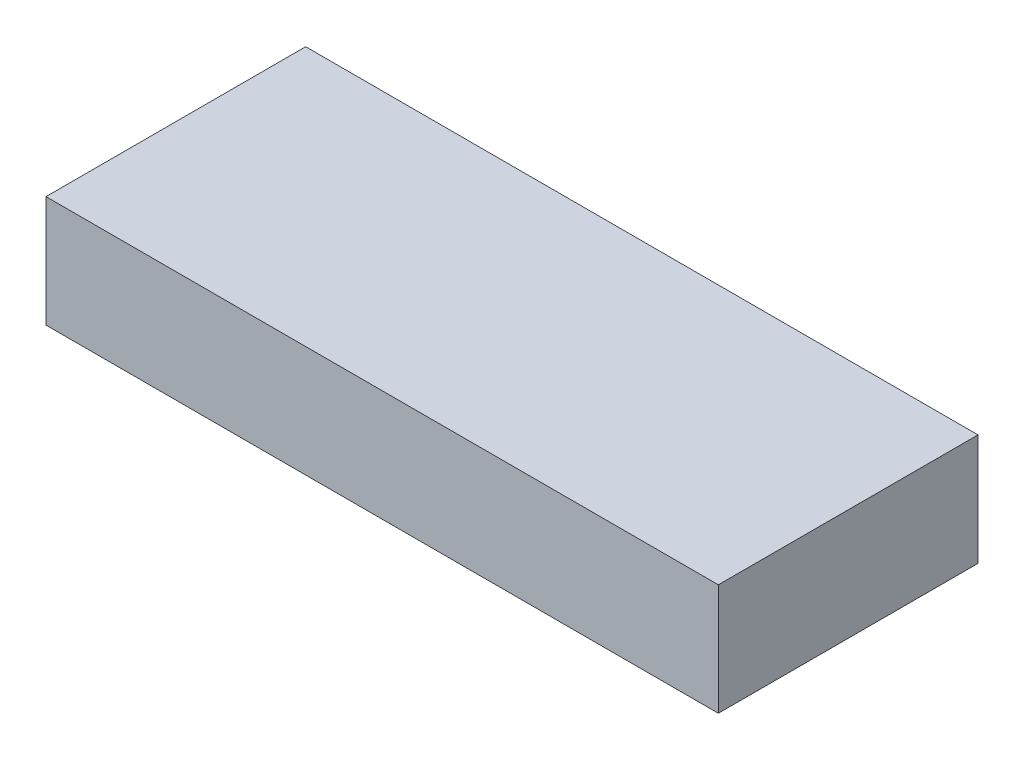
ISO-10303-21;
HEADER;
FILE_DESCRIPTION(('STEP AP214'),'2;1');
FILE_NAME('part.step','',(''),(''),'','','');
FILE_SCHEMA(('AUTOMOTIVE_DESIGN { 1 0 10303 214 1 1 1 1 }'));
ENDSEC;
DATA;
#1=APPLICATION_CONTEXT('core data for automotive mechanical design processes');
#2=APPLICATION_PROTOCOL_DEFINITION('international standard','automotive_design',2000,#1);
#3=PRODUCT_CONTEXT('',#1,'mechanical');
#4=PRODUCT('Part','Part','',(#3));
#5=PRODUCT_RELATED_PRODUCT_CATEGORY('part','',(#4));
#6=PRODUCT_DEFINITION_FORMATION('','',#4);
#7=PRODUCT_DEFINITION_CONTEXT('part definition',#1,'design');
#8=PRODUCT_DEFINITION('design','',#6,#7);
#9=PRODUCT_DEFINITION_SHAPE('','',#8);
#10=(LENGTH_UNIT() NAMED_UNIT(*) SI_UNIT(.MILLI.,.METRE.));
#11=(NAMED_UNIT(*) PLANE_ANGLE_UNIT() SI_UNIT($,.RADIAN.));
#12=(NAMED_UNIT(*) SI_UNIT($,.STERADIAN.) SOLID_ANGLE_UNIT());
#13=UNCERTAINTY_MEASURE_WITH_UNIT(LENGTH_MEASURE(1.E-05),#10,'distance_accuracy_value','');
#14=(GEOMETRIC_REPRESENTATION_CONTEXT(3) GLOBAL_UNCERTAINTY_ASSIGNED_CONTEXT((#13)) GLOBAL_UNIT_ASSIGNED_CONTEXT((#10,
#11,#12)) REPRESENTATION_CONTEXT('',''));
#15=CARTESIAN_POINT('',(0.,0.,0.));
#16=DIRECTION('',(0.,0.,1.));
#17=DIRECTION('',(1.,0.,0.));
#18=AXIS2_PLACEMENT_3D('',#15,#16,#17);
#19=CARTESIAN_POINT('',(0.,38.1,0.));
#20=DIRECTION('',(1.,0.,0.));
#21=DIRECTION('',(0.,0.,-1.));
#22=AXIS2_PLACEMENT_3D('',#19,#20,#21);
#23=PLANE('',#22);
#24=DIRECTION('',(0.,0.,1.));
#25=VECTOR('',#24,1.);
#26=CARTESIAN_POINT('',(0.,0.,0.));
#27=LINE('',#26,#25);
#28=CARTESIAN_POINT('',(0.,0.,-88.9));
#29=VERTEX_POINT('',#28);
#30=CARTESIAN_POINT('',(0.,0.,0.));
#31=VERTEX_POINT('',#30);
#32=EDGE_CURVE('E102',#29,#31,#27,.T.);
#33=ORIENTED_EDGE('',*,*,#32,.T.);
#34=DIRECTION('',(0.,-1.,0.));
#35=VECTOR('',#34,1.);
#36=CARTESIAN_POINT('',(0.,38.1,0.));
#37=LINE('',#36,#35);
#38=CARTESIAN_POINT('',(0.,38.1,0.));
#39=VERTEX_POINT('',#38);
#40=EDGE_CURVE('E11',#39,#31,#37,.T.);
#41=ORIENTED_EDGE('',*,*,#40,.F.);
#42=DIRECTION('',(0.,0.,1.));
#43=VECTOR('',#42,1.);
#44=CARTESIAN_POINT('',(0.,38.1,0.));
#45=LINE('',#44,#43);
#46=CARTESIAN_POINT('',(0.,38.1,-88.9));
#47=VERTEX_POINT('',#46);
#48=EDGE_CURVE('E90',#47,#39,#45,.T.);
#49=ORIENTED_EDGE('',*,*,#48,.F.);
#50=DIRECTION('',(0.,-1.,0.));
#51=VECTOR('',#50,1.);
#52=CARTESIAN_POINT('',(0.,38.1,-88.9));
#53=LINE('',#52,#51);
#54=EDGE_CURVE('E98',#47,#29,#53,.T.);
#55=ORIENTED_EDGE('',*,*,#54,.T.);
#56=EDGE_LOOP('',(#33,#41,#49,#55));
#57=FACE_BOUND('',#56,.T.);
#58=ADVANCED_FACE('F39',(#57),#23,.F.);
#59=CARTESIAN_POINT('',(0.,38.1,0.));
#60=DIRECTION('',(0.,0.,-1.));
#61=DIRECTION('',(-1.,0.,0.));
#62=AXIS2_PLACEMENT_3D('',#59,#60,#61);
#63=PLANE('',#62);
#64=DIRECTION('',(1.,0.,0.));
#65=VECTOR('',#64,1.);
#66=CARTESIAN_POINT('',(0.,0.,0.));
#67=LINE('',#66,#65);
#68=CARTESIAN_POINT('',(230.1875,0.,0.));
#69=VERTEX_POINT('',#68);
#70=EDGE_CURVE('E94',#31,#69,#67,.T.);
#71=ORIENTED_EDGE('',*,*,#70,.T.);
#72=DIRECTION('',(0.,-1.,0.));
#73=VECTOR('',#72,1.);
#74=CARTESIAN_POINT('',(230.1875,38.1,0.));
#75=LINE('',#74,#73);
#76=CARTESIAN_POINT('',(230.1875,38.1,0.));
#77=VERTEX_POINT('',#76);
#78=EDGE_CURVE('E47',#77,#69,#75,.T.);
#79=ORIENTED_EDGE('',*,*,#78,.F.);
#80=DIRECTION('',(1.,0.,0.));
#81=VECTOR('',#80,1.);
#82=CARTESIAN_POINT('',(0.,38.1,0.));
#83=LINE('',#82,#81);
#84=EDGE_CURVE('E85',#39,#77,#83,.T.);
#85=ORIENTED_EDGE('',*,*,#84,.F.);
#86=ORIENTED_EDGE('',*,*,#40,.T.);
#87=EDGE_LOOP('',(#71,#79,#85,#86));
#88=FACE_BOUND('',#87,.T.);
#89=ADVANCED_FACE('F93',(#88),#63,.F.);
#90=CARTESIAN_POINT('',(230.1875,38.1,0.));
#91=DIRECTION('',(-1.,0.,0.));
#92=DIRECTION('',(0.,0.,1.));
#93=AXIS2_PLACEMENT_3D('',#90,#91,#92);
#94=PLANE('',#93);
#95=DIRECTION('',(0.,0.,-1.));
#96=VECTOR('',#95,1.);
#97=CARTESIAN_POINT('',(230.1875,0.,0.));
#98=LINE('',#97,#96);
#99=CARTESIAN_POINT('',(230.1875,0.,-88.9));
#100=VERTEX_POINT('',#99);
#101=EDGE_CURVE('E72',#69,#100,#98,.T.);
#102=ORIENTED_EDGE('',*,*,#101,.T.);
#103=DIRECTION('',(0.,-1.,0.));
#104=VECTOR('',#103,1.);
#105=CARTESIAN_POINT('',(230.1875,38.1,-88.9));
#106=LINE('',#105,#104);
#107=CARTESIAN_POINT('',(230.1875,38.1,-88.9));
#108=VERTEX_POINT('',#107);
#109=EDGE_CURVE('E95',#108,#100,#106,.T.);
#110=ORIENTED_EDGE('',*,*,#109,.F.);
#111=DIRECTION('',(0.,0.,-1.));
#112=VECTOR('',#111,1.);
#113=CARTESIAN_POINT('',(230.1875,38.1,0.));
#114=LINE('',#113,#112);
#115=EDGE_CURVE('E88',#77,#108,#114,.T.);
#116=ORIENTED_EDGE('',*,*,#115,.F.);
#117=ORIENTED_EDGE('',*,*,#78,.T.);
#118=EDGE_LOOP('',(#102,#110,#116,#117));
#119=FACE_BOUND('',#118,.T.);
#120=ADVANCED_FACE('F96',(#119),#94,.F.);
#121=CARTESIAN_POINT('',(0.,38.1,-88.9));
#122=DIRECTION('',(0.,0.,1.));
#123=DIRECTION('',(1.,0.,0.));
#124=AXIS2_PLACEMENT_3D('',#121,#122,#123);
#125=PLANE('',#124);
#126=DIRECTION('',(-1.,0.,0.));
#127=VECTOR('',#126,1.);
#128=CARTESIAN_POINT('',(0.,0.,-88.9));
#129=LINE('',#128,#127);
#130=EDGE_CURVE('E78',#100,#29,#129,.T.);
#131=ORIENTED_EDGE('',*,*,#130,.T.);
#132=ORIENTED_EDGE('',*,*,#54,.F.);
#133=DIRECTION('',(-1.,0.,0.));
#134=VECTOR('',#133,1.);
#135=CARTESIAN_POINT('',(0.,38.1,-88.9));
#136=LINE('',#135,#134);
#137=EDGE_CURVE('E55',#108,#47,#136,.T.);
#138=ORIENTED_EDGE('',*,*,#137,.F.);
#139=ORIENTED_EDGE('',*,*,#109,.T.);
#140=EDGE_LOOP('',(#131,#132,#138,#139));
#141=FACE_BOUND('',#140,.T.);
#142=ADVANCED_FACE('F109',(#141),#125,.F.);
#143=CARTESIAN_POINT('',(0.,38.1,0.));
#144=DIRECTION('',(0.,-1.,0.));
#145=DIRECTION('',(0.,0.,-1.));
#146=AXIS2_PLACEMENT_3D('',#143,#144,#145);
#147=PLANE('',#146);
#148=ORIENTED_EDGE('',*,*,#48,.T.);
#149=ORIENTED_EDGE('',*,*,#84,.T.);
#150=ORIENTED_EDGE('',*,*,#115,.T.);
#151=ORIENTED_EDGE('',*,*,#137,.T.);
#152=EDGE_LOOP('',(#148,#149,#150,#151));
#153=FACE_BOUND('',#152,.T.);
#154=ADVANCED_FACE('F86',(#153),#147,.F.);
#155=CARTESIAN_POINT('',(0.,0.,0.));
#156=DIRECTION('',(0.,-1.,0.));
#157=DIRECTION('',(0.,0.,-1.));
#158=AXIS2_PLACEMENT_3D('',#155,#156,#157);
#159=PLANE('',#158);
#160=ORIENTED_EDGE('',*,*,#32,.F.);
#161=ORIENTED_EDGE('',*,*,#130,.F.);
#162=ORIENTED_EDGE('',*,*,#101,.F.);
#163=ORIENTED_EDGE('',*,*,#70,.F.);
#164=EDGE_LOOP('',(#160,#161,#162,#163));
#165=FACE_BOUND('',#164,.T.);
#166=ADVANCED_FACE('F112',(#165),#159,.T.);
#167=CLOSED_SHELL('',(#58,#89,#120,#142,#154,#166));
#168=MANIFOLD_SOLID_BREP('B2',#167);
#169=ADVANCED_BREP_SHAPE_REPRESENTATION('',(#18,#168),#14);
#170=SHAPE_DEFINITION_REPRESENTATION(#9,#169);
ENDSEC;
END-ISO-10303-21;
